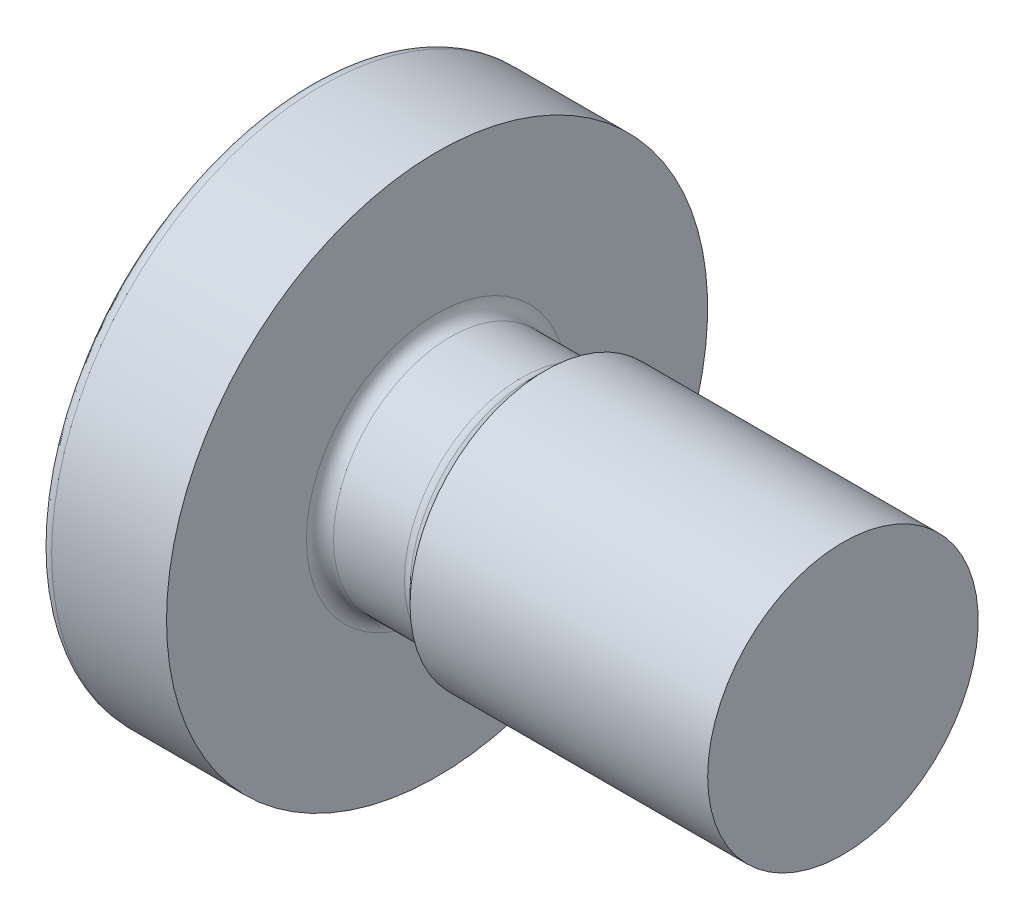
ISO-10303-21;
HEADER;
FILE_DESCRIPTION(('STEP AP214'),'2;1');
FILE_NAME('part.step','',(''),(''),'','','');
FILE_SCHEMA(('AUTOMOTIVE_DESIGN { 1 0 10303 214 1 1 1 1 }'));
ENDSEC;
DATA;
#1=APPLICATION_CONTEXT('core data for automotive mechanical design processes');
#2=APPLICATION_PROTOCOL_DEFINITION('international standard','automotive_design',2000,#1);
#3=PRODUCT_CONTEXT('',#1,'mechanical');
#4=PRODUCT('Part','Part','',(#3));
#5=PRODUCT_RELATED_PRODUCT_CATEGORY('part','',(#4));
#6=PRODUCT_DEFINITION_FORMATION('','',#4);
#7=PRODUCT_DEFINITION_CONTEXT('part definition',#1,'design');
#8=PRODUCT_DEFINITION('design','',#6,#7);
#9=PRODUCT_DEFINITION_SHAPE('','',#8);
#10=(LENGTH_UNIT() NAMED_UNIT(*) SI_UNIT(.MILLI.,.METRE.));
#11=(NAMED_UNIT(*) PLANE_ANGLE_UNIT() SI_UNIT($,.RADIAN.));
#12=(NAMED_UNIT(*) SI_UNIT($,.STERADIAN.) SOLID_ANGLE_UNIT());
#13=UNCERTAINTY_MEASURE_WITH_UNIT(LENGTH_MEASURE(1.E-05),#10,'distance_accuracy_value','');
#14=(GEOMETRIC_REPRESENTATION_CONTEXT(3) GLOBAL_UNCERTAINTY_ASSIGNED_CONTEXT((#13)) GLOBAL_UNIT_ASSIGNED_CONTEXT((#10,
#11,#12)) REPRESENTATION_CONTEXT('',''));
#15=CARTESIAN_POINT('',(0.,0.,0.));
#16=DIRECTION('',(0.,0.,1.));
#17=DIRECTION('',(1.,0.,0.));
#18=AXIS2_PLACEMENT_3D('',#15,#16,#17);
#19=CARTESIAN_POINT('',(3.2,0.,0.));
#20=DIRECTION('',(-1.,0.,0.));
#21=DIRECTION('',(0.,1.,0.));
#22=AXIS2_PLACEMENT_3D('',#19,#20,#21);
#23=SPHERICAL_SURFACE('',#22,3.2);
#24=CARTESIAN_POINT('',(3.00733905955363,-0.273238833376559,0.27323883337656));
#25=DIRECTION('',(-0.446197814505031,-0.632814155313759,0.63281415531376));
#26=DIRECTION('',(0.,-0.707106781186548,-0.707106781186547));
#27=AXIS2_PLACEMENT_3D('',#24,#25,#26);
#28=CIRCLE('',#27,3.17073537872468);
#29=CARTESIAN_POINT('',(0.177236360447901,0.887388815215251,-0.561641406978353));
#30=VERTEX_POINT('',#29);
#31=CARTESIAN_POINT('',(0.177236360447901,0.561641406978353,-0.887388815215251));
#32=VERTEX_POINT('',#31);
#33=EDGE_CURVE('E396',#30,#32,#28,.T.);
#34=ORIENTED_EDGE('',*,*,#33,.F.);
#35=CARTESIAN_POINT('',(3.19835264178886,-0.0134166559625273,-0.012956314058461));
#36=DIRECTION('',(0.0879813128153508,0.716550290756221,0.691964572368025));
#37=DIRECTION('',(0.,-0.694658370458996,0.719339800338652));
#38=AXIS2_PLACEMENT_3D('',#35,#36,#37);
#39=CIRCLE('',#38,3.19994522038733);
#40=CARTESIAN_POINT('',(0.0530596989427369,0.547110975398927,-0.193484682007979));
#41=VERTEX_POINT('',#40);
#42=EDGE_CURVE('E13',#30,#41,#39,.T.);
#43=ORIENTED_EDGE('',*,*,#42,.T.);
#44=CARTESIAN_POINT('',(3.20913082630883,0.0743646126328141,0.0285459002690773));
#45=DIRECTION('',(0.113883497498906,0.927506656060474,0.356036447517575));
#46=DIRECTION('',(0.,-0.358367949545296,0.933580426497203));
#47=AXIS2_PLACEMENT_3D('',#44,#45,#46);
#48=CIRCLE('',#47,3.1989954148102);
#49=CARTESIAN_POINT('',(0.0354504651300946,0.475001306687322,0.));
#50=VERTEX_POINT('',#49);
#51=EDGE_CURVE('E154',#41,#50,#48,.T.);
#52=ORIENTED_EDGE('',*,*,#51,.T.);
#53=CARTESIAN_POINT('',(3.20913082630883,0.0743646126328141,-0.0285459002690773));
#54=DIRECTION('',(0.113883497498906,0.927506656060474,-0.356036447517575));
#55=DIRECTION('',(0.,0.358367949545296,0.933580426497203));
#56=AXIS2_PLACEMENT_3D('',#53,#54,#55);
#57=CIRCLE('',#56,3.1989954148102);
#58=CARTESIAN_POINT('',(0.0530596989431759,0.547110975398873,0.193484682007979));
#59=VERTEX_POINT('',#58);
#60=EDGE_CURVE('E268',#50,#59,#57,.T.);
#61=ORIENTED_EDGE('',*,*,#60,.T.);
#62=CARTESIAN_POINT('',(3.19835264178886,-0.0134166559625274,0.0129563140584611));
#63=DIRECTION('',(0.0879813128153509,0.716550290756221,-0.691964572368025));
#64=DIRECTION('',(0.,0.694658370458996,0.719339800338652));
#65=AXIS2_PLACEMENT_3D('',#62,#63,#64);
#66=CIRCLE('',#65,3.19994522038733);
#67=CARTESIAN_POINT('',(0.177236360447901,0.887388815215251,0.561641406978354));
#68=VERTEX_POINT('',#67);
#69=EDGE_CURVE('E405',#59,#68,#66,.T.);
#70=ORIENTED_EDGE('',*,*,#69,.T.);
#71=CARTESIAN_POINT('',(3.00733905955363,-0.27323883337656,-0.27323883337656));
#72=DIRECTION('',(-0.446197814505031,-0.632814155313759,-0.63281415531376));
#73=DIRECTION('',(0.,0.707106781186548,-0.707106781186547));
#74=AXIS2_PLACEMENT_3D('',#71,#72,#73);
#75=CIRCLE('',#74,3.17073537872468);
#76=CARTESIAN_POINT('',(0.177236360841047,0.561641406861888,0.887388815054509));
#77=VERTEX_POINT('',#76);
#78=EDGE_CURVE('E820',#77,#68,#75,.T.);
#79=ORIENTED_EDGE('',*,*,#78,.F.);
#80=CARTESIAN_POINT('',(3.19835264178886,0.0129563140584607,-0.013416655962527));
#81=DIRECTION('',(0.0879813128153507,-0.691964572368025,0.716550290756221));
#82=DIRECTION('',(0.,-0.719339800338652,-0.694658370458996));
#83=AXIS2_PLACEMENT_3D('',#80,#81,#82);
#84=CIRCLE('',#83,3.19994522038733);
#85=CARTESIAN_POINT('',(0.053059698942737,0.193484682007979,0.547110975398927));
#86=VERTEX_POINT('',#85);
#87=EDGE_CURVE('E815',#77,#86,#84,.T.);
#88=ORIENTED_EDGE('',*,*,#87,.T.);
#89=CARTESIAN_POINT('',(3.20913082630883,-0.0285459002690774,0.0743646126328142));
#90=DIRECTION('',(0.113883497498906,-0.356036447517575,0.927506656060474));
#91=DIRECTION('',(0.,-0.933580426497203,-0.358367949545296));
#92=AXIS2_PLACEMENT_3D('',#89,#90,#91);
#93=CIRCLE('',#92,3.1989954148102);
#94=CARTESIAN_POINT('',(0.0354504651300947,0.,0.475001306687322));
#95=VERTEX_POINT('',#94);
#96=EDGE_CURVE('E811',#86,#95,#93,.T.);
#97=ORIENTED_EDGE('',*,*,#96,.T.);
#98=CARTESIAN_POINT('',(3.20913082630883,0.0285459002690774,0.0743646126328143));
#99=DIRECTION('',(0.113883497498906,0.356036447517574,0.927506656060474));
#100=DIRECTION('',(0.,-0.933580426497203,0.358367949545296));
#101=AXIS2_PLACEMENT_3D('',#98,#99,#100);
#102=CIRCLE('',#101,3.1989954148102);
#103=CARTESIAN_POINT('',(0.0530596989431757,-0.193484682007979,0.547110975398873));
#104=VERTEX_POINT('',#103);
#105=EDGE_CURVE('E807',#95,#104,#102,.T.);
#106=ORIENTED_EDGE('',*,*,#105,.T.);
#107=CARTESIAN_POINT('',(3.19835264178886,-0.0129563140584607,-0.013416655962527));
#108=DIRECTION('',(0.0879813128153506,0.691964572368025,0.71655029075622));
#109=DIRECTION('',(0.,-0.719339800338652,0.694658370458996));
#110=AXIS2_PLACEMENT_3D('',#107,#108,#109);
#111=CIRCLE('',#110,3.19994522038733);
#112=CARTESIAN_POINT('',(0.177236360447901,-0.561641406978353,0.887388815215251));
#113=VERTEX_POINT('',#112);
#114=EDGE_CURVE('E803',#104,#113,#111,.T.);
#115=ORIENTED_EDGE('',*,*,#114,.T.);
#116=CARTESIAN_POINT('',(3.00733905955363,0.273238833376559,-0.27323883337656));
#117=DIRECTION('',(-0.446197814505031,0.632814155313759,-0.63281415531376));
#118=DIRECTION('',(0.,0.707106781186548,0.707106781186547));
#119=AXIS2_PLACEMENT_3D('',#116,#117,#118);
#120=CIRCLE('',#119,3.17073537872468);
#121=CARTESIAN_POINT('',(0.177236360841046,-0.88738881505451,0.561641406861888));
#122=VERTEX_POINT('',#121);
#123=EDGE_CURVE('E799',#122,#113,#120,.T.);
#124=ORIENTED_EDGE('',*,*,#123,.F.);
#125=CARTESIAN_POINT('',(3.19835264178886,0.0134166559625274,0.0129563140584611));
#126=DIRECTION('',(0.0879813128153509,-0.716550290756221,-0.691964572368025));
#127=DIRECTION('',(0.,0.694658370458996,-0.719339800338653));
#128=AXIS2_PLACEMENT_3D('',#125,#126,#127);
#129=CIRCLE('',#128,3.19994522038733);
#130=CARTESIAN_POINT('',(0.0530596989427369,-0.547110975398927,0.193484682007979));
#131=VERTEX_POINT('',#130);
#132=EDGE_CURVE('E794',#122,#131,#129,.T.);
#133=ORIENTED_EDGE('',*,*,#132,.T.);
#134=CARTESIAN_POINT('',(3.20913082630883,-0.0743646126328139,-0.0285459002690773));
#135=DIRECTION('',(0.113883497498906,-0.927506656060474,-0.356036447517575));
#136=DIRECTION('',(0.,0.358367949545296,-0.933580426497203));
#137=AXIS2_PLACEMENT_3D('',#134,#135,#136);
#138=CIRCLE('',#137,3.1989954148102);
#139=CARTESIAN_POINT('',(0.0354504651300946,-0.475001306687322,0.));
#140=VERTEX_POINT('',#139);
#141=EDGE_CURVE('E789',#131,#140,#138,.T.);
#142=ORIENTED_EDGE('',*,*,#141,.T.);
#143=CARTESIAN_POINT('',(3.20913082630883,-0.0743646126328138,0.0285459002690772));
#144=DIRECTION('',(0.113883497498906,-0.927506656060474,0.356036447517575));
#145=DIRECTION('',(0.,-0.358367949545297,-0.933580426497203));
#146=AXIS2_PLACEMENT_3D('',#143,#144,#145);
#147=CIRCLE('',#146,3.1989954148102);
#148=CARTESIAN_POINT('',(0.0530596989431758,-0.547110975398873,-0.193484682007979));
#149=VERTEX_POINT('',#148);
#150=EDGE_CURVE('E784',#140,#149,#147,.T.);
#151=ORIENTED_EDGE('',*,*,#150,.T.);
#152=CARTESIAN_POINT('',(3.19835264178886,0.0134166559625275,-0.0129563140584612));
#153=DIRECTION('',(0.087981312815351,-0.716550290756221,0.691964572368025));
#154=DIRECTION('',(0.,-0.694658370458996,-0.719339800338653));
#155=AXIS2_PLACEMENT_3D('',#152,#153,#154);
#156=CIRCLE('',#155,3.19994522038733);
#157=CARTESIAN_POINT('',(0.177236360447902,-0.887388815215251,-0.561641406978353));
#158=VERTEX_POINT('',#157);
#159=EDGE_CURVE('E779',#149,#158,#156,.T.);
#160=ORIENTED_EDGE('',*,*,#159,.T.);
#161=CARTESIAN_POINT('',(3.00733905955363,0.27323883337656,0.27323883337656));
#162=DIRECTION('',(-0.446197814505031,0.632814155313759,0.63281415531376));
#163=DIRECTION('',(0.,-0.707106781186548,0.707106781186547));
#164=AXIS2_PLACEMENT_3D('',#161,#162,#163);
#165=CIRCLE('',#164,3.17073537872468);
#166=CARTESIAN_POINT('',(0.177236360841047,-0.561641406861888,-0.887388815054509));
#167=VERTEX_POINT('',#166);
#168=EDGE_CURVE('E775',#167,#158,#165,.T.);
#169=ORIENTED_EDGE('',*,*,#168,.F.);
#170=CARTESIAN_POINT('',(3.19835264178886,-0.0129563140584605,0.0134166559625268));
#171=DIRECTION('',(0.0879813128153505,0.691964572368025,-0.71655029075622));
#172=DIRECTION('',(0.,0.719339800338652,0.694658370458996));
#173=AXIS2_PLACEMENT_3D('',#170,#171,#172);
#174=CIRCLE('',#173,3.19994522038733);
#175=CARTESIAN_POINT('',(0.053059698942737,-0.193484682007979,-0.547110975398927));
#176=VERTEX_POINT('',#175);
#177=EDGE_CURVE('E771',#167,#176,#174,.T.);
#178=ORIENTED_EDGE('',*,*,#177,.T.);
#179=CARTESIAN_POINT('',(3.20913082630883,0.0285459002690774,-0.0743646126328143));
#180=DIRECTION('',(0.113883497498906,0.356036447517574,-0.927506656060474));
#181=DIRECTION('',(0.,0.933580426497203,0.358367949545296));
#182=AXIS2_PLACEMENT_3D('',#179,#180,#181);
#183=CIRCLE('',#182,3.1989954148102);
#184=CARTESIAN_POINT('',(0.0354504651300947,0.,-0.475001306687322));
#185=VERTEX_POINT('',#184);
#186=EDGE_CURVE('E767',#176,#185,#183,.T.);
#187=ORIENTED_EDGE('',*,*,#186,.T.);
#188=CARTESIAN_POINT('',(3.20913082630883,-0.0285459002690774,-0.0743646126328142));
#189=DIRECTION('',(0.113883497498906,-0.356036447517575,-0.927506656060474));
#190=DIRECTION('',(0.,0.933580426497203,-0.358367949545296));
#191=AXIS2_PLACEMENT_3D('',#188,#189,#190);
#192=CIRCLE('',#191,3.1989954148102);
#193=CARTESIAN_POINT('',(0.0530596989431759,0.193484682007979,-0.547110975398873));
#194=VERTEX_POINT('',#193);
#195=EDGE_CURVE('E763',#185,#194,#192,.T.);
#196=ORIENTED_EDGE('',*,*,#195,.T.);
#197=CARTESIAN_POINT('',(3.19835264178886,0.0129563140584608,0.0134166559625271));
#198=DIRECTION('',(0.0879813128153508,-0.691964572368025,-0.716550290756221));
#199=DIRECTION('',(0.,0.719339800338652,-0.694658370458996));
#200=AXIS2_PLACEMENT_3D('',#197,#198,#199);
#201=CIRCLE('',#200,3.19994522038733);
#202=EDGE_CURVE('E402',#194,#32,#201,.T.);
#203=ORIENTED_EDGE('',*,*,#202,.T.);
#204=EDGE_LOOP('',(#34,#43,#52,#61,#70,#79,#88,#97,#106,#115,#124,#133,#142,#151,#160,#169,#178,
#187,#196,#203));
#205=FACE_BOUND('',#204,.T.);
#206=CARTESIAN_POINT('',(0.671494459062525,0.,0.));
#207=DIRECTION('',(1.,0.,0.));
#208=DIRECTION('',(0.,0.,-1.));
#209=AXIS2_PLACEMENT_3D('',#206,#207,#208);
#210=CIRCLE('',#209,1.96129032258064);
#211=CARTESIAN_POINT('',(0.671494459062525,0.,-1.96129032258064));
#212=VERTEX_POINT('',#211);
#213=EDGE_CURVE('E908',#212,#212,#210,.F.);
#214=ORIENTED_EDGE('',*,*,#213,.T.);
#215=EDGE_LOOP('',(#214));
#216=FACE_BOUND('',#215,.T.);
#217=ADVANCED_FACE('F144',(#205,#216),#23,.T.);
#218=CARTESIAN_POINT('',(-3.44200137834921,0.,0.));
#219=DIRECTION('',(-1.,0.,0.));
#220=DIRECTION('',(0.,0.,1.));
#221=AXIS2_PLACEMENT_3D('',#218,#219,#220);
#222=CYLINDRICAL_SURFACE('',#221,2.);
#223=CARTESIAN_POINT('',(0.750510257216821,0.,0.));
#224=DIRECTION('',(1.,0.,0.));
#225=DIRECTION('',(0.,0.,-1.));
#226=AXIS2_PLACEMENT_3D('',#223,#224,#225);
#227=CIRCLE('',#226,2.);
#228=CARTESIAN_POINT('',(0.750510257216821,0.,-2.));
#229=VERTEX_POINT('',#228);
#230=EDGE_CURVE('E756',#229,#229,#227,.T.);
#231=ORIENTED_EDGE('',*,*,#230,.T.);
#232=EDGE_LOOP('',(#231));
#233=FACE_BOUND('',#232,.T.);
#234=CARTESIAN_POINT('',(1.6,0.,0.));
#235=DIRECTION('',(-1.,0.,0.));
#236=DIRECTION('',(0.,0.,1.));
#237=AXIS2_PLACEMENT_3D('',#234,#235,#236);
#238=CIRCLE('',#237,2.);
#239=CARTESIAN_POINT('',(1.6,0.,2.));
#240=VERTEX_POINT('',#239);
#241=EDGE_CURVE('E903',#240,#240,#238,.T.);
#242=ORIENTED_EDGE('',*,*,#241,.T.);
#243=EDGE_LOOP('',(#242));
#244=FACE_BOUND('',#243,.T.);
#245=ADVANCED_FACE('F723',(#233,#244),#222,.T.);
#246=CARTESIAN_POINT('',(1.6,2.,0.));
#247=DIRECTION('',(-1.,0.,0.));
#248=DIRECTION('',(0.,0.,1.));
#249=AXIS2_PLACEMENT_3D('',#246,#247,#248);
#250=PLANE('',#249);
#251=CARTESIAN_POINT('',(1.6,0.,0.));
#252=DIRECTION('',(-1.,0.,0.));
#253=DIRECTION('',(0.,0.,1.));
#254=AXIS2_PLACEMENT_3D('',#251,#252,#253);
#255=CIRCLE('',#254,0.966);
#256=CARTESIAN_POINT('',(1.6,0.,0.966));
#257=VERTEX_POINT('',#256);
#258=EDGE_CURVE('E753',#257,#257,#255,.T.);
#259=ORIENTED_EDGE('',*,*,#258,.T.);
#260=EDGE_LOOP('',(#259));
#261=FACE_BOUND('',#260,.T.);
#262=ORIENTED_EDGE('',*,*,#241,.F.);
#263=EDGE_LOOP('',(#262));
#264=FACE_BOUND('',#263,.T.);
#265=ADVANCED_FACE('F728',(#261,#264),#250,.F.);
#266=CARTESIAN_POINT('',(-3.44200137834921,0.,0.));
#267=DIRECTION('',(-1.,0.,0.));
#268=DIRECTION('',(0.,0.,1.));
#269=AXIS2_PLACEMENT_3D('',#266,#267,#268);
#270=CYLINDRICAL_SURFACE('',#269,0.866);
#271=CARTESIAN_POINT('',(2.22457864376269,0.,0.));
#272=DIRECTION('',(-1.,0.,0.));
#273=DIRECTION('',(0.,0.,1.));
#274=AXIS2_PLACEMENT_3D('',#271,#272,#273);
#275=CIRCLE('',#274,0.866);
#276=CARTESIAN_POINT('',(2.22457864376269,0.,0.866));
#277=VERTEX_POINT('',#276);
#278=EDGE_CURVE('E749',#277,#277,#275,.T.);
#279=ORIENTED_EDGE('',*,*,#278,.T.);
#280=EDGE_LOOP('',(#279));
#281=FACE_BOUND('',#280,.T.);
#282=CARTESIAN_POINT('',(1.7,0.,0.));
#283=DIRECTION('',(-1.,0.,0.));
#284=DIRECTION('',(0.,0.,1.));
#285=AXIS2_PLACEMENT_3D('',#282,#283,#284);
#286=CIRCLE('',#285,0.866);
#287=CARTESIAN_POINT('',(1.7,0.,0.866));
#288=VERTEX_POINT('',#287);
#289=EDGE_CURVE('E751',#288,#288,#286,.F.);
#290=ORIENTED_EDGE('',*,*,#289,.T.);
#291=EDGE_LOOP('',(#290));
#292=FACE_BOUND('',#291,.T.);
#293=ADVANCED_FACE('F918',(#281,#292),#270,.T.);
#294=CARTESIAN_POINT('',(2.4,0.,0.));
#295=DIRECTION('',(1.,0.,0.));
#296=DIRECTION('',(0.,0.,-1.));
#297=AXIS2_PLACEMENT_3D('',#294,#295,#296);
#298=CONICAL_SURFACE('',#297,0.999999999999996,0.785398163397439);
#299=CARTESIAN_POINT('',(2.29528932188135,0.,0.));
#300=DIRECTION('',(1.,0.,0.));
#301=DIRECTION('',(0.,0.,-1.));
#302=AXIS2_PLACEMENT_3D('',#299,#300,#301);
#303=CIRCLE('',#302,0.895289321881345);
#304=CARTESIAN_POINT('',(2.29528932188135,0.,-0.895289321881345));
#305=VERTEX_POINT('',#304);
#306=EDGE_CURVE('E746',#305,#305,#303,.T.);
#307=ORIENTED_EDGE('',*,*,#306,.T.);
#308=EDGE_LOOP('',(#307));
#309=FACE_BOUND('',#308,.T.);
#310=CARTESIAN_POINT('',(2.4,0.,0.));
#311=DIRECTION('',(-1.,0.,0.));
#312=DIRECTION('',(0.,0.,1.));
#313=AXIS2_PLACEMENT_3D('',#310,#311,#312);
#314=CIRCLE('',#313,0.999999999999996);
#315=CARTESIAN_POINT('',(2.4,0.,0.999999999999996));
#316=VERTEX_POINT('',#315);
#317=EDGE_CURVE('E896',#316,#316,#314,.T.);
#318=ORIENTED_EDGE('',*,*,#317,.T.);
#319=EDGE_LOOP('',(#318));
#320=FACE_BOUND('',#319,.T.);
#321=ADVANCED_FACE('F923',(#309,#320),#298,.T.);
#322=CARTESIAN_POINT('',(-3.44200137834921,0.,0.));
#323=DIRECTION('',(-1.,0.,0.));
#324=DIRECTION('',(0.,0.,1.));
#325=AXIS2_PLACEMENT_3D('',#322,#323,#324);
#326=CYLINDRICAL_SURFACE('',#325,0.999999999999996);
#327=ORIENTED_EDGE('',*,*,#317,.F.);
#328=EDGE_LOOP('',(#327));
#329=FACE_BOUND('',#328,.T.);
#330=CARTESIAN_POINT('',(4.6,0.,0.));
#331=DIRECTION('',(-1.,0.,0.));
#332=DIRECTION('',(0.,0.,1.));
#333=AXIS2_PLACEMENT_3D('',#330,#331,#332);
#334=CIRCLE('',#333,0.999999999999997);
#335=CARTESIAN_POINT('',(4.6,0.,0.999999999999997));
#336=VERTEX_POINT('',#335);
#337=EDGE_CURVE('E893',#336,#336,#334,.T.);
#338=ORIENTED_EDGE('',*,*,#337,.T.);
#339=EDGE_LOOP('',(#338));
#340=FACE_BOUND('',#339,.T.);
#341=ADVANCED_FACE('F927',(#329,#340),#326,.T.);
#342=CARTESIAN_POINT('',(4.6,0.,0.));
#343=DIRECTION('',(-1.,0.,0.));
#344=DIRECTION('',(0.,0.,1.));
#345=AXIS2_PLACEMENT_3D('',#342,#343,#344);
#346=PLANE('',#345);
#347=ORIENTED_EDGE('',*,*,#337,.F.);
#348=EDGE_LOOP('',(#347));
#349=FACE_BOUND('',#348,.T.);
#350=ADVANCED_FACE('F574',(#349),#346,.F.);
#351=CARTESIAN_POINT('',(0.750510257216821,0.,0.));
#352=DIRECTION('',(1.,0.,0.));
#353=DIRECTION('',(0.,0.,-1.));
#354=AXIS2_PLACEMENT_3D('',#351,#352,#353);
#355=TOROIDAL_SURFACE('',#354,1.9,0.1);
#356=ORIENTED_EDGE('',*,*,#230,.F.);
#357=EDGE_LOOP('',(#356));
#358=FACE_BOUND('',#357,.T.);
#359=ORIENTED_EDGE('',*,*,#213,.F.);
#360=EDGE_LOOP('',(#359));
#361=FACE_BOUND('',#360,.T.);
#362=ADVANCED_FACE('F733',(#358,#361),#355,.T.);
#363=CARTESIAN_POINT('',(2.22457864376269,0.,0.));
#364=DIRECTION('',(-1.,0.,0.));
#365=DIRECTION('',(0.,0.,1.));
#366=AXIS2_PLACEMENT_3D('',#363,#364,#365);
#367=TOROIDAL_SURFACE('',#366,0.966,0.1);
#368=ORIENTED_EDGE('',*,*,#306,.F.);
#369=EDGE_LOOP('',(#368));
#370=FACE_BOUND('',#369,.T.);
#371=ORIENTED_EDGE('',*,*,#278,.F.);
#372=EDGE_LOOP('',(#371));
#373=FACE_BOUND('',#372,.T.);
#374=ADVANCED_FACE('F735',(#370,#373),#367,.F.);
#375=CARTESIAN_POINT('',(1.7,0.,0.));
#376=DIRECTION('',(-1.,0.,0.));
#377=DIRECTION('',(0.,0.,1.));
#378=AXIS2_PLACEMENT_3D('',#375,#376,#377);
#379=TOROIDAL_SURFACE('',#378,0.966,0.1);
#380=ORIENTED_EDGE('',*,*,#289,.F.);
#381=EDGE_LOOP('',(#380));
#382=FACE_BOUND('',#381,.T.);
#383=ORIENTED_EDGE('',*,*,#258,.F.);
#384=EDGE_LOOP('',(#383));
#385=FACE_BOUND('',#384,.T.);
#386=ADVANCED_FACE('F146',(#382,#385),#379,.F.);
#387=CARTESIAN_POINT('',(0.,0.959853768072267,-0.614145966921614));
#388=DIRECTION('',(0.0879813128153508,0.716550290756221,0.691964572368025));
#389=DIRECTION('',(0.,-0.694658370458996,0.719339800338652));
#390=AXIS2_PLACEMENT_3D('',#387,#388,#389);
#391=PLANE('',#390);
#392=DIRECTION('',(-0.892670261136446,0.364977639050131,-0.264444942995667));
#393=VECTOR('',#392,1.);
#394=CARTESIAN_POINT('',(0.71,0.669562789412697,-0.403815324464797));
#395=LINE('',#394,#393);
#396=CARTESIAN_POINT('',(1.42,0.379271810753127,-0.193484682007979));
#397=VERTEX_POINT('',#396);
#398=EDGE_CURVE('E271',#397,#30,#395,.T.);
#399=ORIENTED_EDGE('',*,*,#398,.F.);
#400=DIRECTION('',(0.992546151641322,-0.121869343405147,0.));
#401=VECTOR('',#400,1.);
#402=CARTESIAN_POINT('',(0.71,0.466448848994189,-0.193484682007979));
#403=LINE('',#402,#401);
#404=EDGE_CURVE('E288',#41,#397,#403,.T.);
#405=ORIENTED_EDGE('',*,*,#404,.F.);
#406=ORIENTED_EDGE('',*,*,#42,.F.);
#407=EDGE_LOOP('',(#399,#405,#406));
#408=FACE_BOUND('',#407,.T.);
#409=ADVANCED_FACE('F319',(#408),#391,.F.);
#410=CARTESIAN_POINT('',(0.,0.479354076482125,0.));
#411=DIRECTION('',(0.113883497498906,0.927506656060474,0.356036447517575));
#412=DIRECTION('',(0.,-0.358367949545296,0.933580426497203));
#413=AXIS2_PLACEMENT_3D('',#410,#411,#412);
#414=PLANE('',#413);
#415=ORIENTED_EDGE('',*,*,#404,.T.);
#416=DIRECTION('',(0.,-0.3583679495453,0.933580426497202));
#417=VECTOR('',#416,1.);
#418=CARTESIAN_POINT('',(1.42,0.305,0.));
#419=LINE('',#418,#417);
#420=CARTESIAN_POINT('',(1.42,0.305,0.));
#421=VERTEX_POINT('',#420);
#422=EDGE_CURVE('E280',#397,#421,#419,.T.);
#423=ORIENTED_EDGE('',*,*,#422,.T.);
#424=DIRECTION('',(0.992546151641322,-0.121869343405147,0.));
#425=VECTOR('',#424,1.);
#426=CARTESIAN_POINT('',(0.,0.479354076482125,0.));
#427=LINE('',#426,#425);
#428=EDGE_CURVE('E260',#50,#421,#427,.T.);
#429=ORIENTED_EDGE('',*,*,#428,.F.);
#430=ORIENTED_EDGE('',*,*,#51,.F.);
#431=EDGE_LOOP('',(#415,#423,#429,#430));
#432=FACE_BOUND('',#431,.T.);
#433=ADVANCED_FACE('F287',(#432),#414,.F.);
#434=CARTESIAN_POINT('',(1.42,0.379271810753127,-0.193484682007979));
#435=DIRECTION('',(-0.446197814505031,-0.632814155313759,0.63281415531376));
#436=DIRECTION('',(0.,-0.707106781186548,-0.707106781186547));
#437=AXIS2_PLACEMENT_3D('',#434,#435,#436);
#438=PLANE('',#437);
#439=ORIENTED_EDGE('',*,*,#33,.T.);
#440=DIRECTION('',(0.892670261136446,-0.264444942995668,0.364977639050131));
#441=VECTOR('',#440,1.);
#442=CARTESIAN_POINT('',(0.71,0.403815324464796,-0.669562789412697));
#443=LINE('',#442,#441);
#444=CARTESIAN_POINT('',(1.42,0.193484682007979,-0.379271810753127));
#445=VERTEX_POINT('',#444);
#446=EDGE_CURVE('E162',#32,#445,#443,.T.);
#447=ORIENTED_EDGE('',*,*,#446,.T.);
#448=DIRECTION('',(0.,0.707106781186548,0.707106781186547));
#449=VECTOR('',#448,1.);
#450=CARTESIAN_POINT('',(1.42,0.379271810753127,-0.193484682007979));
#451=LINE('',#450,#449);
#452=EDGE_CURVE('E291',#445,#397,#451,.T.);
#453=ORIENTED_EDGE('',*,*,#452,.T.);
#454=ORIENTED_EDGE('',*,*,#398,.T.);
#455=EDGE_LOOP('',(#439,#447,#453,#454));
#456=FACE_BOUND('',#455,.T.);
#457=ADVANCED_FACE('F332',(#456),#438,.T.);
#458=CARTESIAN_POINT('',(0.,0.479354076482125,0.));
#459=DIRECTION('',(0.113883497498906,0.927506656060474,-0.356036447517575));
#460=DIRECTION('',(0.,0.358367949545296,0.933580426497203));
#461=AXIS2_PLACEMENT_3D('',#458,#459,#460);
#462=PLANE('',#461);
#463=ORIENTED_EDGE('',*,*,#428,.T.);
#464=DIRECTION('',(0.,0.3583679495453,0.933580426497202));
#465=VECTOR('',#464,1.);
#466=CARTESIAN_POINT('',(1.42,0.305,0.));
#467=LINE('',#466,#465);
#468=CARTESIAN_POINT('',(1.42,0.379271810753127,0.193484682007979));
#469=VERTEX_POINT('',#468);
#470=EDGE_CURVE('E265',#421,#469,#467,.T.);
#471=ORIENTED_EDGE('',*,*,#470,.T.);
#472=DIRECTION('',(0.992546151641322,-0.121869343405147,0.));
#473=VECTOR('',#472,1.);
#474=CARTESIAN_POINT('',(0.,0.553625887235251,0.193484682007979));
#475=LINE('',#474,#473);
#476=EDGE_CURVE('E272',#59,#469,#475,.T.);
#477=ORIENTED_EDGE('',*,*,#476,.F.);
#478=ORIENTED_EDGE('',*,*,#60,.F.);
#479=EDGE_LOOP('',(#463,#471,#477,#478));
#480=FACE_BOUND('',#479,.T.);
#481=ADVANCED_FACE('F263',(#480),#462,.F.);
#482=CARTESIAN_POINT('',(0.,0.553625887235251,0.193484682007979));
#483=DIRECTION('',(0.0879813128153509,0.716550290756221,-0.691964572368025));
#484=DIRECTION('',(0.,0.694658370458996,0.719339800338652));
#485=AXIS2_PLACEMENT_3D('',#482,#483,#484);
#486=PLANE('',#485);
#487=ORIENTED_EDGE('',*,*,#476,.T.);
#488=DIRECTION('',(0.892670261136446,-0.364977639050131,-0.264444942995667));
#489=VECTOR('',#488,1.);
#490=CARTESIAN_POINT('',(0.71,0.669562789412697,0.403815324464797));
#491=LINE('',#490,#489);
#492=EDGE_CURVE('E526',#68,#469,#491,.T.);
#493=ORIENTED_EDGE('',*,*,#492,.F.);
#494=ORIENTED_EDGE('',*,*,#69,.F.);
#495=EDGE_LOOP('',(#487,#493,#494));
#496=FACE_BOUND('',#495,.T.);
#497=ADVANCED_FACE('F376',(#496),#486,.F.);
#498=CARTESIAN_POINT('',(1.42,0.193484682007979,0.379271810753127));
#499=DIRECTION('',(-0.446197814505031,-0.632814155313759,-0.63281415531376));
#500=DIRECTION('',(0.,0.707106781186548,-0.707106781186547));
#501=AXIS2_PLACEMENT_3D('',#498,#499,#500);
#502=PLANE('',#501);
#503=ORIENTED_EDGE('',*,*,#78,.T.);
#504=ORIENTED_EDGE('',*,*,#492,.T.);
#505=DIRECTION('',(0.,-0.707106781186548,0.707106781186547));
#506=VECTOR('',#505,1.);
#507=CARTESIAN_POINT('',(1.42,0.379271810753127,0.193484682007979));
#508=LINE('',#507,#506);
#509=CARTESIAN_POINT('',(1.42,0.193484682007979,0.379271810753127));
#510=VERTEX_POINT('',#509);
#511=EDGE_CURVE('E284',#469,#510,#508,.T.);
#512=ORIENTED_EDGE('',*,*,#511,.T.);
#513=DIRECTION('',(-0.892670261136446,0.264444942995668,0.364977639050131));
#514=VECTOR('',#513,1.);
#515=CARTESIAN_POINT('',(0.71,0.403815324464797,0.669562789412697));
#516=LINE('',#515,#514);
#517=EDGE_CURVE('E541',#510,#77,#516,.T.);
#518=ORIENTED_EDGE('',*,*,#517,.T.);
#519=EDGE_LOOP('',(#503,#504,#512,#518));
#520=FACE_BOUND('',#519,.T.);
#521=ADVANCED_FACE('F830',(#520),#502,.T.);
#522=CARTESIAN_POINT('',(0.,0.614145966921614,0.959853768072267));
#523=DIRECTION('',(0.0879813128153507,-0.691964572368025,0.716550290756221));
#524=DIRECTION('',(0.,-0.719339800338652,-0.694658370458996));
#525=AXIS2_PLACEMENT_3D('',#522,#523,#524);
#526=PLANE('',#525);
#527=ORIENTED_EDGE('',*,*,#517,.F.);
#528=DIRECTION('',(0.992546151641322,0.,-0.121869343405147));
#529=VECTOR('',#528,1.);
#530=CARTESIAN_POINT('',(0.71,0.193484682007979,0.466448848994189));
#531=LINE('',#530,#529);
#532=EDGE_CURVE('E524',#86,#510,#531,.T.);
#533=ORIENTED_EDGE('',*,*,#532,.F.);
#534=ORIENTED_EDGE('',*,*,#87,.F.);
#535=EDGE_LOOP('',(#527,#533,#534));
#536=FACE_BOUND('',#535,.T.);
#537=ADVANCED_FACE('F834',(#536),#526,.F.);
#538=CARTESIAN_POINT('',(0.,0.,0.479354076482125));
#539=DIRECTION('',(0.113883497498906,-0.356036447517575,0.927506656060474));
#540=DIRECTION('',(0.,-0.933580426497203,-0.358367949545296));
#541=AXIS2_PLACEMENT_3D('',#538,#539,#540);
#542=PLANE('',#541);
#543=ORIENTED_EDGE('',*,*,#532,.T.);
#544=DIRECTION('',(0.,-0.933580426497202,-0.3583679495453));
#545=VECTOR('',#544,1.);
#546=CARTESIAN_POINT('',(1.42,0.,0.305));
#547=LINE('',#546,#545);
#548=CARTESIAN_POINT('',(1.42,0.,0.305));
#549=VERTEX_POINT('',#548);
#550=EDGE_CURVE('E419',#510,#549,#547,.T.);
#551=ORIENTED_EDGE('',*,*,#550,.T.);
#552=DIRECTION('',(0.992546151641322,0.,-0.121869343405147));
#553=VECTOR('',#552,1.);
#554=CARTESIAN_POINT('',(0.,0.,0.479354076482125));
#555=LINE('',#554,#553);
#556=EDGE_CURVE('E148',#95,#549,#555,.T.);
#557=ORIENTED_EDGE('',*,*,#556,.F.);
#558=ORIENTED_EDGE('',*,*,#96,.F.);
#559=EDGE_LOOP('',(#543,#551,#557,#558));
#560=FACE_BOUND('',#559,.T.);
#561=ADVANCED_FACE('F455',(#560),#542,.F.);
#562=CARTESIAN_POINT('',(0.,0.,0.479354076482125));
#563=DIRECTION('',(0.113883497498906,0.356036447517574,0.927506656060474));
#564=DIRECTION('',(0.,-0.933580426497203,0.358367949545296));
#565=AXIS2_PLACEMENT_3D('',#562,#563,#564);
#566=PLANE('',#565);
#567=ORIENTED_EDGE('',*,*,#556,.T.);
#568=DIRECTION('',(0.,-0.933580426497202,0.3583679495453));
#569=VECTOR('',#568,1.);
#570=CARTESIAN_POINT('',(1.42,0.,0.305));
#571=LINE('',#570,#569);
#572=CARTESIAN_POINT('',(1.42,-0.193484682007979,0.379271810753127));
#573=VERTEX_POINT('',#572);
#574=EDGE_CURVE('E416',#549,#573,#571,.T.);
#575=ORIENTED_EDGE('',*,*,#574,.T.);
#576=DIRECTION('',(0.992546151641322,0.,-0.121869343405147));
#577=VECTOR('',#576,1.);
#578=CARTESIAN_POINT('',(0.,-0.193484682007979,0.553625887235251));
#579=LINE('',#578,#577);
#580=EDGE_CURVE('E423',#104,#573,#579,.T.);
#581=ORIENTED_EDGE('',*,*,#580,.F.);
#582=ORIENTED_EDGE('',*,*,#105,.F.);
#583=EDGE_LOOP('',(#567,#575,#581,#582));
#584=FACE_BOUND('',#583,.T.);
#585=ADVANCED_FACE('F444',(#584),#566,.F.);
#586=CARTESIAN_POINT('',(0.,-0.193484682007979,0.553625887235251));
#587=DIRECTION('',(0.0879813128153506,0.691964572368025,0.71655029075622));
#588=DIRECTION('',(0.,-0.719339800338652,0.694658370458996));
#589=AXIS2_PLACEMENT_3D('',#586,#587,#588);
#590=PLANE('',#589);
#591=ORIENTED_EDGE('',*,*,#580,.T.);
#592=DIRECTION('',(0.892670261136446,0.264444942995668,-0.364977639050131));
#593=VECTOR('',#592,1.);
#594=CARTESIAN_POINT('',(0.71,-0.403815324464796,0.669562789412697));
#595=LINE('',#594,#593);
#596=EDGE_CURVE('E426',#113,#573,#595,.T.);
#597=ORIENTED_EDGE('',*,*,#596,.F.);
#598=ORIENTED_EDGE('',*,*,#114,.F.);
#599=EDGE_LOOP('',(#591,#597,#598));
#600=FACE_BOUND('',#599,.T.);
#601=ADVANCED_FACE('F454',(#600),#590,.F.);
#602=CARTESIAN_POINT('',(1.42,-0.379271810753127,0.193484682007979));
#603=DIRECTION('',(-0.446197814505031,0.632814155313759,-0.63281415531376));
#604=DIRECTION('',(0.,0.707106781186548,0.707106781186547));
#605=AXIS2_PLACEMENT_3D('',#602,#603,#604);
#606=PLANE('',#605);
#607=ORIENTED_EDGE('',*,*,#123,.T.);
#608=ORIENTED_EDGE('',*,*,#596,.T.);
#609=DIRECTION('',(0.,-0.707106781186548,-0.707106781186547));
#610=VECTOR('',#609,1.);
#611=CARTESIAN_POINT('',(1.42,-0.379271810753127,0.193484682007979));
#612=LINE('',#611,#610);
#613=CARTESIAN_POINT('',(1.42,-0.379271810753127,0.193484682007979));
#614=VERTEX_POINT('',#613);
#615=EDGE_CURVE('E420',#573,#614,#612,.T.);
#616=ORIENTED_EDGE('',*,*,#615,.T.);
#617=DIRECTION('',(-0.892670261136446,-0.364977639050131,0.264444942995667));
#618=VECTOR('',#617,1.);
#619=CARTESIAN_POINT('',(0.71,-0.669562789412697,0.403815324464797));
#620=LINE('',#619,#618);
#621=EDGE_CURVE('E1165',#614,#122,#620,.T.);
#622=ORIENTED_EDGE('',*,*,#621,.T.);
#623=EDGE_LOOP('',(#607,#608,#616,#622));
#624=FACE_BOUND('',#623,.T.);
#625=ADVANCED_FACE('F462',(#624),#606,.T.);
#626=CARTESIAN_POINT('',(0.,-0.959853768072267,0.614145966921614));
#627=DIRECTION('',(0.0879813128153509,-0.716550290756221,-0.691964572368025));
#628=DIRECTION('',(0.,0.694658370458996,-0.719339800338653));
#629=AXIS2_PLACEMENT_3D('',#626,#627,#628);
#630=PLANE('',#629);
#631=ORIENTED_EDGE('',*,*,#621,.F.);
#632=DIRECTION('',(0.992546151641322,0.121869343405147,0.));
#633=VECTOR('',#632,1.);
#634=CARTESIAN_POINT('',(0.71,-0.466448848994189,0.193484682007979));
#635=LINE('',#634,#633);
#636=EDGE_CURVE('E1168',#131,#614,#635,.T.);
#637=ORIENTED_EDGE('',*,*,#636,.F.);
#638=ORIENTED_EDGE('',*,*,#132,.F.);
#639=EDGE_LOOP('',(#631,#637,#638));
#640=FACE_BOUND('',#639,.T.);
#641=ADVANCED_FACE('F1031',(#640),#630,.F.);
#642=CARTESIAN_POINT('',(0.,-0.479354076482125,0.));
#643=DIRECTION('',(0.113883497498906,-0.927506656060474,-0.356036447517575));
#644=DIRECTION('',(0.,0.358367949545296,-0.933580426497203));
#645=AXIS2_PLACEMENT_3D('',#642,#643,#644);
#646=PLANE('',#645);
#647=ORIENTED_EDGE('',*,*,#636,.T.);
#648=DIRECTION('',(0.,0.3583679495453,-0.933580426497202));
#649=VECTOR('',#648,1.);
#650=CARTESIAN_POINT('',(1.42,-0.305,0.));
#651=LINE('',#650,#649);
#652=CARTESIAN_POINT('',(1.42,-0.305,0.));
#653=VERTEX_POINT('',#652);
#654=EDGE_CURVE('E1171',#614,#653,#651,.T.);
#655=ORIENTED_EDGE('',*,*,#654,.T.);
#656=DIRECTION('',(0.992546151641322,0.121869343405147,0.));
#657=VECTOR('',#656,1.);
#658=CARTESIAN_POINT('',(0.,-0.479354076482125,0.));
#659=LINE('',#658,#657);
#660=EDGE_CURVE('E1132',#140,#653,#659,.T.);
#661=ORIENTED_EDGE('',*,*,#660,.F.);
#662=ORIENTED_EDGE('',*,*,#141,.F.);
#663=EDGE_LOOP('',(#647,#655,#661,#662));
#664=FACE_BOUND('',#663,.T.);
#665=ADVANCED_FACE('F1039',(#664),#646,.F.);
#666=CARTESIAN_POINT('',(0.,-0.479354076482125,0.));
#667=DIRECTION('',(0.113883497498906,-0.927506656060474,0.356036447517575));
#668=DIRECTION('',(0.,-0.358367949545297,-0.933580426497203));
#669=AXIS2_PLACEMENT_3D('',#666,#667,#668);
#670=PLANE('',#669);
#671=ORIENTED_EDGE('',*,*,#660,.T.);
#672=DIRECTION('',(0.,-0.3583679495453,-0.933580426497202));
#673=VECTOR('',#672,1.);
#674=CARTESIAN_POINT('',(1.42,-0.305,0.));
#675=LINE('',#674,#673);
#676=CARTESIAN_POINT('',(1.42,-0.379271810753127,-0.193484682007979));
#677=VERTEX_POINT('',#676);
#678=EDGE_CURVE('E602',#653,#677,#675,.T.);
#679=ORIENTED_EDGE('',*,*,#678,.T.);
#680=DIRECTION('',(0.992546151641322,0.121869343405147,0.));
#681=VECTOR('',#680,1.);
#682=CARTESIAN_POINT('',(0.,-0.553625887235251,-0.193484682007979));
#683=LINE('',#682,#681);
#684=EDGE_CURVE('E1126',#149,#677,#683,.T.);
#685=ORIENTED_EDGE('',*,*,#684,.F.);
#686=ORIENTED_EDGE('',*,*,#150,.F.);
#687=EDGE_LOOP('',(#671,#679,#685,#686));
#688=FACE_BOUND('',#687,.T.);
#689=ADVANCED_FACE('F1048',(#688),#670,.F.);
#690=CARTESIAN_POINT('',(0.,-0.553625887235251,-0.193484682007979));
#691=DIRECTION('',(0.087981312815351,-0.716550290756221,0.691964572368025));
#692=DIRECTION('',(0.,-0.694658370458996,-0.719339800338653));
#693=AXIS2_PLACEMENT_3D('',#690,#691,#692);
#694=PLANE('',#693);
#695=ORIENTED_EDGE('',*,*,#684,.T.);
#696=DIRECTION('',(0.892670261136446,0.364977639050131,0.264444942995667));
#697=VECTOR('',#696,1.);
#698=CARTESIAN_POINT('',(0.71,-0.669562789412697,-0.403815324464797));
#699=LINE('',#698,#697);
#700=EDGE_CURVE('E615',#158,#677,#699,.T.);
#701=ORIENTED_EDGE('',*,*,#700,.F.);
#702=ORIENTED_EDGE('',*,*,#159,.F.);
#703=EDGE_LOOP('',(#695,#701,#702));
#704=FACE_BOUND('',#703,.T.);
#705=ADVANCED_FACE('F1058',(#704),#694,.F.);
#706=CARTESIAN_POINT('',(1.42,-0.193484682007979,-0.379271810753127));
#707=DIRECTION('',(-0.446197814505031,0.632814155313759,0.63281415531376));
#708=DIRECTION('',(0.,-0.707106781186548,0.707106781186547));
#709=AXIS2_PLACEMENT_3D('',#706,#707,#708);
#710=PLANE('',#709);
#711=ORIENTED_EDGE('',*,*,#168,.T.);
#712=ORIENTED_EDGE('',*,*,#700,.T.);
#713=DIRECTION('',(0.,0.707106781186548,-0.707106781186547));
#714=VECTOR('',#713,1.);
#715=CARTESIAN_POINT('',(1.42,-0.379271810753127,-0.193484682007979));
#716=LINE('',#715,#714);
#717=CARTESIAN_POINT('',(1.42,-0.193484682007979,-0.379271810753127));
#718=VERTEX_POINT('',#717);
#719=EDGE_CURVE('E598',#677,#718,#716,.T.);
#720=ORIENTED_EDGE('',*,*,#719,.T.);
#721=DIRECTION('',(-0.892670261136446,-0.264444942995668,-0.364977639050131));
#722=VECTOR('',#721,1.);
#723=CARTESIAN_POINT('',(0.71,-0.403815324464797,-0.669562789412697));
#724=LINE('',#723,#722);
#725=EDGE_CURVE('E611',#718,#167,#724,.T.);
#726=ORIENTED_EDGE('',*,*,#725,.T.);
#727=EDGE_LOOP('',(#711,#712,#720,#726));
#728=FACE_BOUND('',#727,.T.);
#729=ADVANCED_FACE('F646',(#728),#710,.T.);
#730=CARTESIAN_POINT('',(0.,-0.614145966921614,-0.959853768072267));
#731=DIRECTION('',(0.0879813128153505,0.691964572368025,-0.71655029075622));
#732=DIRECTION('',(0.,0.719339800338652,0.694658370458996));
#733=AXIS2_PLACEMENT_3D('',#730,#731,#732);
#734=PLANE('',#733);
#735=ORIENTED_EDGE('',*,*,#725,.F.);
#736=DIRECTION('',(0.992546151641322,0.,0.121869343405147));
#737=VECTOR('',#736,1.);
#738=CARTESIAN_POINT('',(0.71,-0.193484682007979,-0.466448848994189));
#739=LINE('',#738,#737);
#740=EDGE_CURVE('E604',#176,#718,#739,.T.);
#741=ORIENTED_EDGE('',*,*,#740,.F.);
#742=ORIENTED_EDGE('',*,*,#177,.F.);
#743=EDGE_LOOP('',(#735,#741,#742));
#744=FACE_BOUND('',#743,.T.);
#745=ADVANCED_FACE('F635',(#744),#734,.F.);
#746=CARTESIAN_POINT('',(0.,0.,-0.479354076482125));
#747=DIRECTION('',(0.113883497498906,0.356036447517574,-0.927506656060474));
#748=DIRECTION('',(0.,0.933580426497203,0.358367949545296));
#749=AXIS2_PLACEMENT_3D('',#746,#747,#748);
#750=PLANE('',#749);
#751=ORIENTED_EDGE('',*,*,#740,.T.);
#752=DIRECTION('',(0.,0.933580426497202,0.3583679495453));
#753=VECTOR('',#752,1.);
#754=CARTESIAN_POINT('',(1.42,0.,-0.305));
#755=LINE('',#754,#753);
#756=CARTESIAN_POINT('',(1.42,0.,-0.305));
#757=VERTEX_POINT('',#756);
#758=EDGE_CURVE('E603',#718,#757,#755,.T.);
#759=ORIENTED_EDGE('',*,*,#758,.T.);
#760=DIRECTION('',(0.992546151641322,0.,0.121869343405147));
#761=VECTOR('',#760,1.);
#762=CARTESIAN_POINT('',(0.,0.,-0.479354076482125));
#763=LINE('',#762,#761);
#764=EDGE_CURVE('E616',#185,#757,#763,.T.);
#765=ORIENTED_EDGE('',*,*,#764,.F.);
#766=ORIENTED_EDGE('',*,*,#186,.F.);
#767=EDGE_LOOP('',(#751,#759,#765,#766));
#768=FACE_BOUND('',#767,.T.);
#769=ADVANCED_FACE('F645',(#768),#750,.F.);
#770=CARTESIAN_POINT('',(0.,0.,-0.479354076482125));
#771=DIRECTION('',(0.113883497498906,-0.356036447517575,-0.927506656060474));
#772=DIRECTION('',(0.,0.933580426497203,-0.358367949545296));
#773=AXIS2_PLACEMENT_3D('',#770,#771,#772);
#774=PLANE('',#773);
#775=ORIENTED_EDGE('',*,*,#764,.T.);
#776=DIRECTION('',(0.,0.933580426497202,-0.3583679495453));
#777=VECTOR('',#776,1.);
#778=CARTESIAN_POINT('',(1.42,0.,-0.305));
#779=LINE('',#778,#777);
#780=EDGE_CURVE('E293',#757,#445,#779,.T.);
#781=ORIENTED_EDGE('',*,*,#780,.T.);
#782=DIRECTION('',(0.992546151641322,0.,0.121869343405147));
#783=VECTOR('',#782,1.);
#784=CARTESIAN_POINT('',(0.,0.193484682007979,-0.553625887235251));
#785=LINE('',#784,#783);
#786=EDGE_CURVE('E700',#194,#445,#785,.T.);
#787=ORIENTED_EDGE('',*,*,#786,.F.);
#788=ORIENTED_EDGE('',*,*,#195,.F.);
#789=EDGE_LOOP('',(#775,#781,#787,#788));
#790=FACE_BOUND('',#789,.T.);
#791=ADVANCED_FACE('F709',(#790),#774,.F.);
#792=CARTESIAN_POINT('',(0.,0.193484682007979,-0.553625887235251));
#793=DIRECTION('',(0.0879813128153508,-0.691964572368025,-0.716550290756221));
#794=DIRECTION('',(0.,0.719339800338652,-0.694658370458996));
#795=AXIS2_PLACEMENT_3D('',#792,#793,#794);
#796=PLANE('',#795);
#797=ORIENTED_EDGE('',*,*,#786,.T.);
#798=ORIENTED_EDGE('',*,*,#446,.F.);
#799=ORIENTED_EDGE('',*,*,#202,.F.);
#800=EDGE_LOOP('',(#797,#798,#799));
#801=FACE_BOUND('',#800,.T.);
#802=ADVANCED_FACE('F571',(#801),#796,.F.);
#803=CARTESIAN_POINT('',(1.42,0.367872003355028,-0.163787168415577));
#804=DIRECTION('',(-1.,0.,0.));
#805=DIRECTION('',(0.,0.,1.));
#806=AXIS2_PLACEMENT_3D('',#803,#804,#805);
#807=PLANE('',#806);
#808=ORIENTED_EDGE('',*,*,#422,.F.);
#809=ORIENTED_EDGE('',*,*,#452,.F.);
#810=ORIENTED_EDGE('',*,*,#780,.F.);
#811=ORIENTED_EDGE('',*,*,#758,.F.);
#812=ORIENTED_EDGE('',*,*,#719,.F.);
#813=ORIENTED_EDGE('',*,*,#678,.F.);
#814=ORIENTED_EDGE('',*,*,#654,.F.);
#815=ORIENTED_EDGE('',*,*,#615,.F.);
#816=ORIENTED_EDGE('',*,*,#574,.F.);
#817=ORIENTED_EDGE('',*,*,#550,.F.);
#818=ORIENTED_EDGE('',*,*,#511,.F.);
#819=ORIENTED_EDGE('',*,*,#470,.F.);
#820=EDGE_LOOP('',(#808,#809,#810,#811,#812,#813,#814,#815,#816,#817,#818,#819));
#821=FACE_BOUND('',#820,.T.);
#822=ADVANCED_FACE('F278',(#821),#807,.T.);
#823=CLOSED_SHELL('',(#217,#245,#265,#293,#321,#341,#350,#362,#374,#386,#409,#433,#457,#481,
#497,#521,#537,#561,#585,#601,#625,#641,#665,#689,#705,#729,#745,#769,#791,#802,#822));
#824=MANIFOLD_SOLID_BREP('B2',#823);
#825=ADVANCED_BREP_SHAPE_REPRESENTATION('',(#18,#824),#14);
#826=SHAPE_DEFINITION_REPRESENTATION(#9,#825);
ENDSEC;
END-ISO-10303-21;
